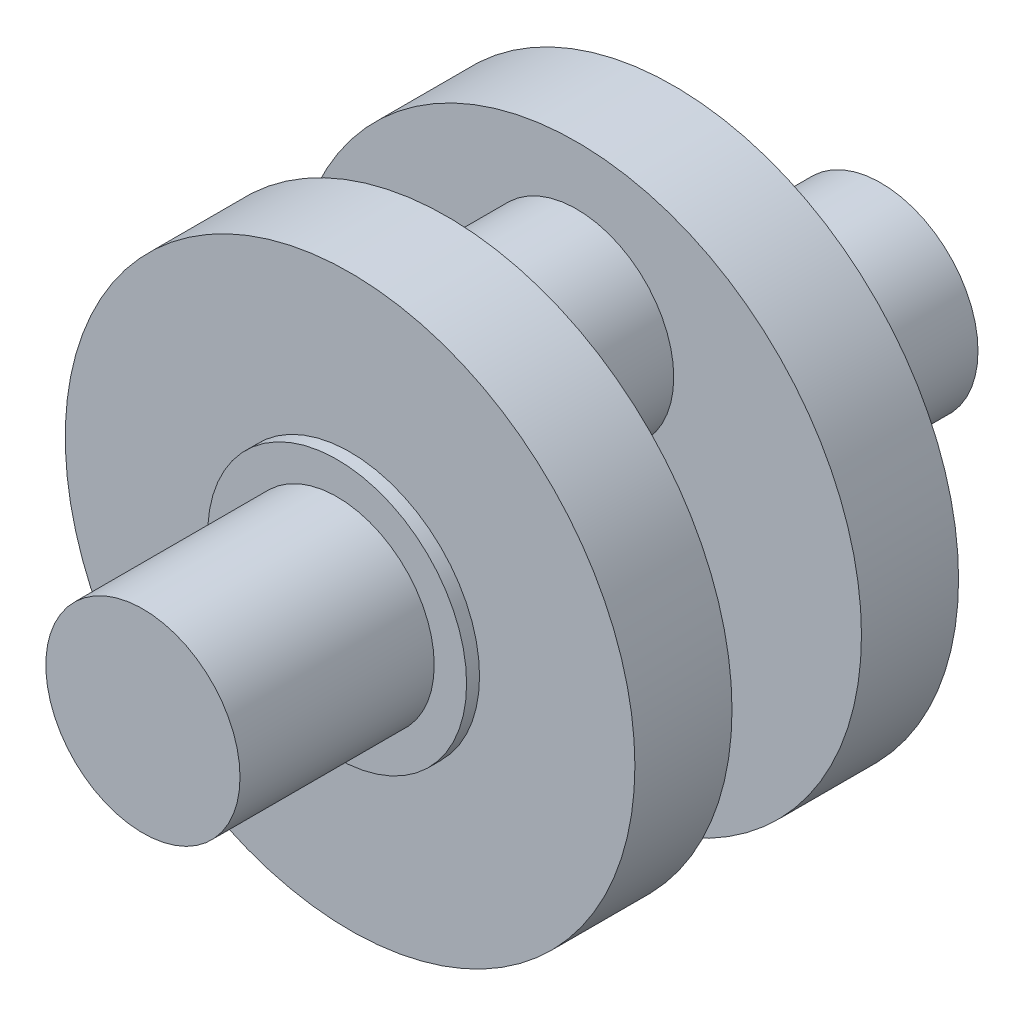
ISO-10303-21;
HEADER;
FILE_DESCRIPTION(('STEP AP214'),'2;1');
FILE_NAME('part.step','',(''),(''),'','','');
FILE_SCHEMA(('AUTOMOTIVE_DESIGN { 1 0 10303 214 1 1 1 1 }'));
ENDSEC;
DATA;
#1=APPLICATION_CONTEXT('core data for automotive mechanical design processes');
#2=APPLICATION_PROTOCOL_DEFINITION('international standard','automotive_design',2000,#1);
#3=PRODUCT_CONTEXT('',#1,'mechanical');
#4=PRODUCT('Part','Part','',(#3));
#5=PRODUCT_RELATED_PRODUCT_CATEGORY('part','',(#4));
#6=PRODUCT_DEFINITION_FORMATION('','',#4);
#7=PRODUCT_DEFINITION_CONTEXT('part definition',#1,'design');
#8=PRODUCT_DEFINITION('design','',#6,#7);
#9=PRODUCT_DEFINITION_SHAPE('','',#8);
#10=(LENGTH_UNIT() NAMED_UNIT(*) SI_UNIT(.MILLI.,.METRE.));
#11=(NAMED_UNIT(*) PLANE_ANGLE_UNIT() SI_UNIT($,.RADIAN.));
#12=(NAMED_UNIT(*) SI_UNIT($,.STERADIAN.) SOLID_ANGLE_UNIT());
#13=UNCERTAINTY_MEASURE_WITH_UNIT(LENGTH_MEASURE(1.E-05),#10,'distance_accuracy_value','');
#14=(GEOMETRIC_REPRESENTATION_CONTEXT(3) GLOBAL_UNCERTAINTY_ASSIGNED_CONTEXT((#13)) GLOBAL_UNIT_ASSIGNED_CONTEXT((#10,
#11,#12)) REPRESENTATION_CONTEXT('',''));
#15=CARTESIAN_POINT('',(0.,0.,0.));
#16=DIRECTION('',(0.,0.,1.));
#17=DIRECTION('',(1.,0.,0.));
#18=AXIS2_PLACEMENT_3D('',#15,#16,#17);
#19=CARTESIAN_POINT('',(0.,0.,30.));
#20=DIRECTION('',(0.,0.,-1.));
#21=DIRECTION('',(-1.,0.,0.));
#22=AXIS2_PLACEMENT_3D('',#19,#20,#21);
#23=CYLINDRICAL_SURFACE('',#22,15.);
#24=CARTESIAN_POINT('',(0.,0.,30.));
#25=DIRECTION('',(0.,0.,1.));
#26=DIRECTION('',(1.,0.,0.));
#27=AXIS2_PLACEMENT_3D('',#24,#25,#26);
#28=CIRCLE('',#27,15.);
#29=CARTESIAN_POINT('',(15.,0.,30.));
#30=VERTEX_POINT('',#29);
#31=EDGE_CURVE('E10',#30,#30,#28,.T.);
#32=ORIENTED_EDGE('',*,*,#31,.F.);
#33=EDGE_LOOP('',(#32));
#34=FACE_BOUND('',#33,.T.);
#35=CARTESIAN_POINT('',(0.,0.,0.));
#36=DIRECTION('',(0.,0.,1.));
#37=DIRECTION('',(1.,0.,0.));
#38=AXIS2_PLACEMENT_3D('',#35,#36,#37);
#39=CIRCLE('',#38,15.);
#40=CARTESIAN_POINT('',(15.,0.,0.));
#41=VERTEX_POINT('',#40);
#42=EDGE_CURVE('E44',#41,#41,#39,.T.);
#43=ORIENTED_EDGE('',*,*,#42,.T.);
#44=EDGE_LOOP('',(#43));
#45=FACE_BOUND('',#44,.T.);
#46=ADVANCED_FACE('F41',(#34,#45),#23,.T.);
#47=CARTESIAN_POINT('',(0.,0.,30.));
#48=DIRECTION('',(0.,0.,1.));
#49=DIRECTION('',(1.,0.,0.));
#50=AXIS2_PLACEMENT_3D('',#47,#48,#49);
#51=PLANE('',#50);
#52=ORIENTED_EDGE('',*,*,#31,.T.);
#53=EDGE_LOOP('',(#52));
#54=FACE_BOUND('',#53,.T.);
#55=ADVANCED_FACE('F125',(#54),#51,.T.);
#56=CARTESIAN_POINT('',(0.,0.,-2.));
#57=DIRECTION('',(0.,0.,1.));
#58=DIRECTION('',(1.,0.,0.));
#59=AXIS2_PLACEMENT_3D('',#56,#57,#58);
#60=CYLINDRICAL_SURFACE('',#59,20.);
#61=CARTESIAN_POINT('',(0.,0.,-2.));
#62=DIRECTION('',(0.,0.,1.));
#63=DIRECTION('',(1.,0.,0.));
#64=AXIS2_PLACEMENT_3D('',#61,#62,#63);
#65=CIRCLE('',#64,20.);
#66=CARTESIAN_POINT('',(20.,0.,-2.));
#67=VERTEX_POINT('',#66);
#68=EDGE_CURVE('E58',#67,#67,#65,.T.);
#69=ORIENTED_EDGE('',*,*,#68,.T.);
#70=EDGE_LOOP('',(#69));
#71=FACE_BOUND('',#70,.T.);
#72=CARTESIAN_POINT('',(0.,0.,0.));
#73=DIRECTION('',(0.,0.,1.));
#74=DIRECTION('',(1.,0.,0.));
#75=AXIS2_PLACEMENT_3D('',#72,#73,#74);
#76=CIRCLE('',#75,20.);
#77=CARTESIAN_POINT('',(20.,0.,0.));
#78=VERTEX_POINT('',#77);
#79=EDGE_CURVE('E53',#78,#78,#76,.T.);
#80=ORIENTED_EDGE('',*,*,#79,.F.);
#81=EDGE_LOOP('',(#80));
#82=FACE_BOUND('',#81,.T.);
#83=ADVANCED_FACE('F130',(#71,#82),#60,.T.);
#84=CARTESIAN_POINT('',(0.,0.,0.));
#85=DIRECTION('',(0.,0.,1.));
#86=DIRECTION('',(1.,0.,0.));
#87=AXIS2_PLACEMENT_3D('',#84,#85,#86);
#88=PLANE('',#87);
#89=ORIENTED_EDGE('',*,*,#42,.F.);
#90=EDGE_LOOP('',(#89));
#91=FACE_BOUND('',#90,.T.);
#92=ORIENTED_EDGE('',*,*,#79,.T.);
#93=EDGE_LOOP('',(#92));
#94=FACE_BOUND('',#93,.T.);
#95=ADVANCED_FACE('F134',(#91,#94),#88,.T.);
#96=CARTESIAN_POINT('',(0.,0.,-17.));
#97=DIRECTION('',(0.,0.,1.));
#98=DIRECTION('',(1.,0.,0.));
#99=AXIS2_PLACEMENT_3D('',#96,#97,#98);
#100=CYLINDRICAL_SURFACE('',#99,44.);
#101=CARTESIAN_POINT('',(0.,0.,-17.));
#102=DIRECTION('',(0.,0.,1.));
#103=DIRECTION('',(1.,0.,0.));
#104=AXIS2_PLACEMENT_3D('',#101,#102,#103);
#105=CIRCLE('',#104,44.);
#106=CARTESIAN_POINT('',(44.,0.,-17.));
#107=VERTEX_POINT('',#106);
#108=EDGE_CURVE('E62',#107,#107,#105,.T.);
#109=ORIENTED_EDGE('',*,*,#108,.T.);
#110=EDGE_LOOP('',(#109));
#111=FACE_BOUND('',#110,.T.);
#112=CARTESIAN_POINT('',(0.,0.,-2.));
#113=DIRECTION('',(0.,0.,1.));
#114=DIRECTION('',(1.,0.,0.));
#115=AXIS2_PLACEMENT_3D('',#112,#113,#114);
#116=CIRCLE('',#115,44.);
#117=CARTESIAN_POINT('',(44.,0.,-2.));
#118=VERTEX_POINT('',#117);
#119=EDGE_CURVE('E63',#118,#118,#116,.T.);
#120=ORIENTED_EDGE('',*,*,#119,.F.);
#121=EDGE_LOOP('',(#120));
#122=FACE_BOUND('',#121,.T.);
#123=ADVANCED_FACE('F137',(#111,#122),#100,.T.);
#124=CARTESIAN_POINT('',(0.,0.,-17.));
#125=DIRECTION('',(0.,0.,1.));
#126=DIRECTION('',(1.,0.,0.));
#127=AXIS2_PLACEMENT_3D('',#124,#125,#126);
#128=PLANE('',#127);
#129=CARTESIAN_POINT('',(0.,20.,-17.));
#130=DIRECTION('',(0.,0.,1.));
#131=DIRECTION('',(1.,0.,0.));
#132=AXIS2_PLACEMENT_3D('',#129,#130,#131);
#133=CIRCLE('',#132,15.);
#134=CARTESIAN_POINT('',(15.,20.,-17.));
#135=VERTEX_POINT('',#134);
#136=EDGE_CURVE('E67',#135,#135,#133,.T.);
#137=ORIENTED_EDGE('',*,*,#136,.T.);
#138=EDGE_LOOP('',(#137));
#139=FACE_BOUND('',#138,.T.);
#140=ORIENTED_EDGE('',*,*,#108,.F.);
#141=EDGE_LOOP('',(#140));
#142=FACE_BOUND('',#141,.T.);
#143=ADVANCED_FACE('F149',(#139,#142),#128,.F.);
#144=CARTESIAN_POINT('',(0.,0.,-2.));
#145=DIRECTION('',(0.,0.,1.));
#146=DIRECTION('',(1.,0.,0.));
#147=AXIS2_PLACEMENT_3D('',#144,#145,#146);
#148=PLANE('',#147);
#149=ORIENTED_EDGE('',*,*,#68,.F.);
#150=EDGE_LOOP('',(#149));
#151=FACE_BOUND('',#150,.T.);
#152=ORIENTED_EDGE('',*,*,#119,.T.);
#153=EDGE_LOOP('',(#152));
#154=FACE_BOUND('',#153,.T.);
#155=ADVANCED_FACE('F151',(#151,#154),#148,.T.);
#156=CARTESIAN_POINT('',(0.,20.,-27.));
#157=DIRECTION('',(0.,0.,1.));
#158=DIRECTION('',(1.,0.,0.));
#159=AXIS2_PLACEMENT_3D('',#156,#157,#158);
#160=CYLINDRICAL_SURFACE('',#159,15.);
#161=ORIENTED_EDGE('',*,*,#136,.F.);
#162=EDGE_LOOP('',(#161));
#163=FACE_BOUND('',#162,.T.);
#164=CARTESIAN_POINT('',(0.,20.,-37.));
#165=DIRECTION('',(0.,0.,1.));
#166=DIRECTION('',(1.,0.,0.));
#167=AXIS2_PLACEMENT_3D('',#164,#165,#166);
#168=CIRCLE('',#167,15.);
#169=CARTESIAN_POINT('',(15.,20.,-37.));
#170=VERTEX_POINT('',#169);
#171=EDGE_CURVE('E95',#170,#170,#168,.T.);
#172=ORIENTED_EDGE('',*,*,#171,.T.);
#173=EDGE_LOOP('',(#172));
#174=FACE_BOUND('',#173,.T.);
#175=ADVANCED_FACE('F103',(#163,#174),#160,.T.);
#176=CARTESIAN_POINT('',(0.,0.,-84.));
#177=DIRECTION('',(0.,0.,1.));
#178=DIRECTION('',(-1.,0.,0.));
#179=AXIS2_PLACEMENT_3D('',#176,#177,#178);
#180=CYLINDRICAL_SURFACE('',#179,15.);
#181=CARTESIAN_POINT('',(0.,0.,-84.));
#182=DIRECTION('',(0.,0.,1.));
#183=DIRECTION('',(1.,0.,0.));
#184=AXIS2_PLACEMENT_3D('',#181,#182,#183);
#185=CIRCLE('',#184,15.);
#186=CARTESIAN_POINT('',(15.,0.,-84.));
#187=VERTEX_POINT('',#186);
#188=EDGE_CURVE('E74',#187,#187,#185,.T.);
#189=ORIENTED_EDGE('',*,*,#188,.T.);
#190=EDGE_LOOP('',(#189));
#191=FACE_BOUND('',#190,.T.);
#192=CARTESIAN_POINT('',(0.,0.,-54.));
#193=DIRECTION('',(0.,0.,1.));
#194=DIRECTION('',(1.,0.,0.));
#195=AXIS2_PLACEMENT_3D('',#192,#193,#194);
#196=CIRCLE('',#195,15.);
#197=CARTESIAN_POINT('',(15.,0.,-54.));
#198=VERTEX_POINT('',#197);
#199=EDGE_CURVE('E75',#198,#198,#196,.T.);
#200=ORIENTED_EDGE('',*,*,#199,.F.);
#201=EDGE_LOOP('',(#200));
#202=FACE_BOUND('',#201,.T.);
#203=ADVANCED_FACE('F160',(#191,#202),#180,.T.);
#204=CARTESIAN_POINT('',(0.,0.,-84.));
#205=DIRECTION('',(0.,0.,-1.));
#206=DIRECTION('',(1.,0.,0.));
#207=AXIS2_PLACEMENT_3D('',#204,#205,#206);
#208=PLANE('',#207);
#209=ORIENTED_EDGE('',*,*,#188,.F.);
#210=EDGE_LOOP('',(#209));
#211=FACE_BOUND('',#210,.T.);
#212=ADVANCED_FACE('F164',(#211),#208,.T.);
#213=CARTESIAN_POINT('',(0.,0.,-52.));
#214=DIRECTION('',(0.,0.,-1.));
#215=DIRECTION('',(1.,0.,0.));
#216=AXIS2_PLACEMENT_3D('',#213,#214,#215);
#217=CYLINDRICAL_SURFACE('',#216,20.);
#218=CARTESIAN_POINT('',(0.,0.,-52.));
#219=DIRECTION('',(0.,0.,1.));
#220=DIRECTION('',(1.,0.,0.));
#221=AXIS2_PLACEMENT_3D('',#218,#219,#220);
#222=CIRCLE('',#221,20.);
#223=CARTESIAN_POINT('',(20.,0.,-52.));
#224=VERTEX_POINT('',#223);
#225=EDGE_CURVE('E86',#224,#224,#222,.T.);
#226=ORIENTED_EDGE('',*,*,#225,.F.);
#227=EDGE_LOOP('',(#226));
#228=FACE_BOUND('',#227,.T.);
#229=CARTESIAN_POINT('',(0.,0.,-54.));
#230=DIRECTION('',(0.,0.,1.));
#231=DIRECTION('',(1.,0.,0.));
#232=AXIS2_PLACEMENT_3D('',#229,#230,#231);
#233=CIRCLE('',#232,20.);
#234=CARTESIAN_POINT('',(20.,0.,-54.));
#235=VERTEX_POINT('',#234);
#236=EDGE_CURVE('E79',#235,#235,#233,.T.);
#237=ORIENTED_EDGE('',*,*,#236,.T.);
#238=EDGE_LOOP('',(#237));
#239=FACE_BOUND('',#238,.T.);
#240=ADVANCED_FACE('F168',(#228,#239),#217,.T.);
#241=CARTESIAN_POINT('',(0.,0.,-54.));
#242=DIRECTION('',(0.,0.,-1.));
#243=DIRECTION('',(1.,0.,0.));
#244=AXIS2_PLACEMENT_3D('',#241,#242,#243);
#245=PLANE('',#244);
#246=ORIENTED_EDGE('',*,*,#199,.T.);
#247=EDGE_LOOP('',(#246));
#248=FACE_BOUND('',#247,.T.);
#249=ORIENTED_EDGE('',*,*,#236,.F.);
#250=EDGE_LOOP('',(#249));
#251=FACE_BOUND('',#250,.T.);
#252=ADVANCED_FACE('F115',(#248,#251),#245,.T.);
#253=CARTESIAN_POINT('',(0.,0.,-37.));
#254=DIRECTION('',(0.,0.,-1.));
#255=DIRECTION('',(1.,0.,0.));
#256=AXIS2_PLACEMENT_3D('',#253,#254,#255);
#257=CYLINDRICAL_SURFACE('',#256,44.);
#258=CARTESIAN_POINT('',(0.,0.,-37.));
#259=DIRECTION('',(0.,0.,1.));
#260=DIRECTION('',(1.,0.,0.));
#261=AXIS2_PLACEMENT_3D('',#258,#259,#260);
#262=CIRCLE('',#261,44.);
#263=CARTESIAN_POINT('',(44.,0.,-37.));
#264=VERTEX_POINT('',#263);
#265=EDGE_CURVE('E90',#264,#264,#262,.T.);
#266=ORIENTED_EDGE('',*,*,#265,.F.);
#267=EDGE_LOOP('',(#266));
#268=FACE_BOUND('',#267,.T.);
#269=CARTESIAN_POINT('',(0.,0.,-52.));
#270=DIRECTION('',(0.,0.,1.));
#271=DIRECTION('',(1.,0.,0.));
#272=AXIS2_PLACEMENT_3D('',#269,#270,#271);
#273=CIRCLE('',#272,44.);
#274=CARTESIAN_POINT('',(44.,0.,-52.));
#275=VERTEX_POINT('',#274);
#276=EDGE_CURVE('E91',#275,#275,#273,.T.);
#277=ORIENTED_EDGE('',*,*,#276,.T.);
#278=EDGE_LOOP('',(#277));
#279=FACE_BOUND('',#278,.T.);
#280=ADVANCED_FACE('F109',(#268,#279),#257,.T.);
#281=CARTESIAN_POINT('',(0.,0.,-37.));
#282=DIRECTION('',(0.,0.,-1.));
#283=DIRECTION('',(1.,0.,0.));
#284=AXIS2_PLACEMENT_3D('',#281,#282,#283);
#285=PLANE('',#284);
#286=ORIENTED_EDGE('',*,*,#171,.F.);
#287=EDGE_LOOP('',(#286));
#288=FACE_BOUND('',#287,.T.);
#289=ORIENTED_EDGE('',*,*,#265,.T.);
#290=EDGE_LOOP('',(#289));
#291=FACE_BOUND('',#290,.T.);
#292=ADVANCED_FACE('F105',(#288,#291),#285,.F.);
#293=CARTESIAN_POINT('',(0.,0.,-52.));
#294=DIRECTION('',(0.,0.,-1.));
#295=DIRECTION('',(1.,0.,0.));
#296=AXIS2_PLACEMENT_3D('',#293,#294,#295);
#297=PLANE('',#296);
#298=ORIENTED_EDGE('',*,*,#225,.T.);
#299=EDGE_LOOP('',(#298));
#300=FACE_BOUND('',#299,.T.);
#301=ORIENTED_EDGE('',*,*,#276,.F.);
#302=EDGE_LOOP('',(#301));
#303=FACE_BOUND('',#302,.T.);
#304=ADVANCED_FACE('F108',(#300,#303),#297,.T.);
#305=CLOSED_SHELL('',(#46,#55,#83,#95,#123,#143,#155,#175,#203,#212,#240,#252,#280,#292,#304));
#306=MANIFOLD_SOLID_BREP('B2',#305);
#307=ADVANCED_BREP_SHAPE_REPRESENTATION('',(#18,#306),#14);
#308=SHAPE_DEFINITION_REPRESENTATION(#9,#307);
ENDSEC;
END-ISO-10303-21;
